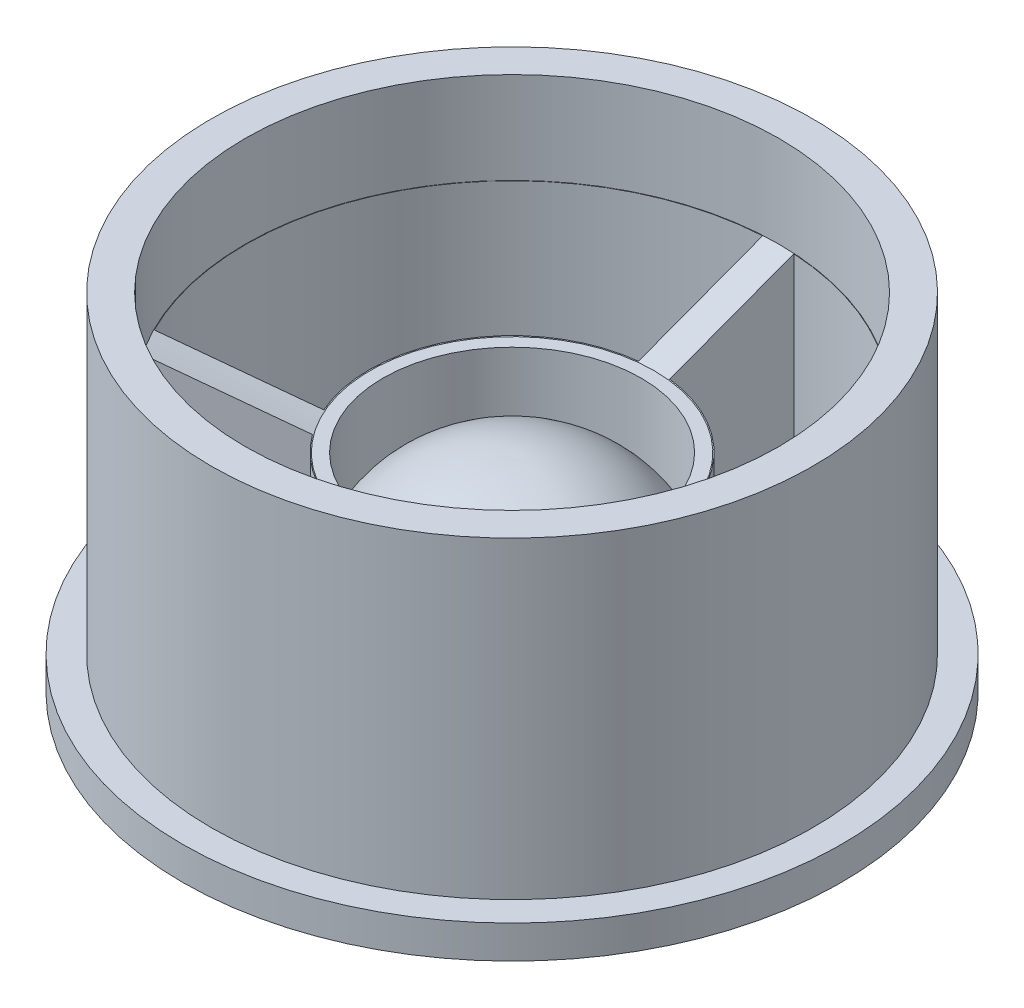
ISO-10303-21;
HEADER;
FILE_DESCRIPTION(('STEP AP214'),'2;1');
FILE_NAME('part.step','',(''),(''),'','','');
FILE_SCHEMA(('AUTOMOTIVE_DESIGN { 1 0 10303 214 1 1 1 1 }'));
ENDSEC;
DATA;
#1=APPLICATION_CONTEXT('core data for automotive mechanical design processes');
#2=APPLICATION_PROTOCOL_DEFINITION('international standard','automotive_design',2000,#1);
#3=PRODUCT_CONTEXT('',#1,'mechanical');
#4=PRODUCT('Part','Part','',(#3));
#5=PRODUCT_RELATED_PRODUCT_CATEGORY('part','',(#4));
#6=PRODUCT_DEFINITION_FORMATION('','',#4);
#7=PRODUCT_DEFINITION_CONTEXT('part definition',#1,'design');
#8=PRODUCT_DEFINITION('design','',#6,#7);
#9=PRODUCT_DEFINITION_SHAPE('','',#8);
#10=(LENGTH_UNIT() NAMED_UNIT(*) SI_UNIT(.MILLI.,.METRE.));
#11=(NAMED_UNIT(*) PLANE_ANGLE_UNIT() SI_UNIT($,.RADIAN.));
#12=(NAMED_UNIT(*) SI_UNIT($,.STERADIAN.) SOLID_ANGLE_UNIT());
#13=UNCERTAINTY_MEASURE_WITH_UNIT(LENGTH_MEASURE(1.E-05),#10,'distance_accuracy_value','');
#14=(GEOMETRIC_REPRESENTATION_CONTEXT(3) GLOBAL_UNCERTAINTY_ASSIGNED_CONTEXT((#13)) GLOBAL_UNIT_ASSIGNED_CONTEXT((#10,
#11,#12)) REPRESENTATION_CONTEXT('',''));
#15=CARTESIAN_POINT('',(0.,0.,0.));
#16=DIRECTION('',(0.,0.,1.));
#17=DIRECTION('',(1.,0.,0.));
#18=AXIS2_PLACEMENT_3D('',#15,#16,#17);
#19=CARTESIAN_POINT('',(0.,1.,0.));
#20=DIRECTION('',(0.,-1.,0.));
#21=DIRECTION('',(0.,0.,-1.));
#22=AXIS2_PLACEMENT_3D('',#19,#20,#21);
#23=CYLINDRICAL_SURFACE('',#22,10.);
#24=CARTESIAN_POINT('',(0.,1.,0.));
#25=DIRECTION('',(0.,1.,0.));
#26=DIRECTION('',(0.,0.,1.));
#27=AXIS2_PLACEMENT_3D('',#24,#25,#26);
#28=CIRCLE('',#27,10.);
#29=CARTESIAN_POINT('',(0.,1.,10.));
#30=VERTEX_POINT('',#29);
#31=EDGE_CURVE('E157',#30,#30,#28,.T.);
#32=ORIENTED_EDGE('',*,*,#31,.F.);
#33=EDGE_LOOP('',(#32));
#34=FACE_BOUND('',#33,.T.);
#35=CARTESIAN_POINT('',(0.,0.,0.));
#36=DIRECTION('',(0.,1.,0.));
#37=DIRECTION('',(0.,0.,1.));
#38=AXIS2_PLACEMENT_3D('',#35,#36,#37);
#39=CIRCLE('',#38,10.);
#40=CARTESIAN_POINT('',(0.,0.,10.));
#41=VERTEX_POINT('',#40);
#42=EDGE_CURVE('E160',#41,#41,#39,.T.);
#43=ORIENTED_EDGE('',*,*,#42,.T.);
#44=EDGE_LOOP('',(#43));
#45=FACE_BOUND('',#44,.T.);
#46=ADVANCED_FACE('F36',(#34,#45),#23,.T.);
#47=CARTESIAN_POINT('',(0.,1.,0.));
#48=DIRECTION('',(0.,1.,0.));
#49=DIRECTION('',(0.,0.,1.));
#50=AXIS2_PLACEMENT_3D('',#47,#48,#49);
#51=PLANE('',#50);
#52=CARTESIAN_POINT('',(0.,1.,0.));
#53=DIRECTION('',(0.,1.,0.));
#54=DIRECTION('',(0.,0.,1.));
#55=AXIS2_PLACEMENT_3D('',#52,#53,#54);
#56=CIRCLE('',#55,9.12834848091899);
#57=CARTESIAN_POINT('',(0.,1.,9.12834848091899));
#58=VERTEX_POINT('',#57);
#59=EDGE_CURVE('E162',#58,#58,#56,.T.);
#60=ORIENTED_EDGE('',*,*,#59,.F.);
#61=EDGE_LOOP('',(#60));
#62=FACE_BOUND('',#61,.T.);
#63=ORIENTED_EDGE('',*,*,#31,.T.);
#64=EDGE_LOOP('',(#63));
#65=FACE_BOUND('',#64,.T.);
#66=ADVANCED_FACE('F146',(#62,#65),#51,.T.);
#67=CARTESIAN_POINT('',(0.,0.,0.));
#68=DIRECTION('',(0.,1.,0.));
#69=DIRECTION('',(0.,0.,1.));
#70=AXIS2_PLACEMENT_3D('',#67,#68,#69);
#71=PLANE('',#70);
#72=CARTESIAN_POINT('',(0.,0.,0.));
#73=DIRECTION('',(0.,-1.,0.));
#74=DIRECTION('',(0.,0.,-1.));
#75=AXIS2_PLACEMENT_3D('',#72,#73,#74);
#76=CIRCLE('',#75,4.27485755579937);
#77=CARTESIAN_POINT('',(0.,0.,-4.27485755579937));
#78=VERTEX_POINT('',#77);
#79=EDGE_CURVE('E11',#78,#78,#76,.T.);
#80=ORIENTED_EDGE('',*,*,#79,.F.);
#81=EDGE_LOOP('',(#80));
#82=FACE_BOUND('',#81,.T.);
#83=ORIENTED_EDGE('',*,*,#42,.F.);
#84=EDGE_LOOP('',(#83));
#85=FACE_BOUND('',#84,.T.);
#86=DIRECTION('',(0.866025403784438,0.,-0.500000000000001));
#87=VECTOR('',#86,1.);
#88=CARTESIAN_POINT('',(0.236570300981502,0.,0.409751780861823));
#89=LINE('',#88,#87);
#90=CARTESIAN_POINT('',(-6.75726344424227,0.,4.44764357633426));
#91=VERTEX_POINT('',#90);
#92=CARTESIAN_POINT('',(-3.4940899034705,0.,2.56364945415722));
#93=VERTEX_POINT('',#92);
#94=EDGE_CURVE('E217',#91,#93,#89,.T.);
#95=ORIENTED_EDGE('',*,*,#94,.F.);
#96=CARTESIAN_POINT('',(0.,0.,0.));
#97=DIRECTION('',(0.,1.,0.));
#98=DIRECTION('',(0.,0.,1.));
#99=AXIS2_PLACEMENT_3D('',#96,#97,#98);
#100=CIRCLE('',#99,8.08963179860495);
#101=CARTESIAN_POINT('',(6.75726344424228,0.,4.44764357633426));
#102=VERTEX_POINT('',#101);
#103=EDGE_CURVE('E208',#91,#102,#100,.T.);
#104=ORIENTED_EDGE('',*,*,#103,.T.);
#105=DIRECTION('',(-0.866025403784439,0.,-0.5));
#106=VECTOR('',#105,1.);
#107=CARTESIAN_POINT('',(-0.236570300981502,0.,0.409751780861823));
#108=LINE('',#107,#106);
#109=CARTESIAN_POINT('',(3.49408990347051,0.,2.56364945415721));
#110=VERTEX_POINT('',#109);
#111=EDGE_CURVE('E211',#102,#110,#108,.T.);
#112=ORIENTED_EDGE('',*,*,#111,.T.);
#113=CARTESIAN_POINT('',(0.,0.,0.));
#114=DIRECTION('',(0.,1.,0.));
#115=DIRECTION('',(0.,0.,1.));
#116=AXIS2_PLACEMENT_3D('',#113,#114,#115);
#117=CIRCLE('',#116,4.33370081770017);
#118=EDGE_CURVE('E214',#93,#110,#117,.T.);
#119=ORIENTED_EDGE('',*,*,#118,.F.);
#120=EDGE_LOOP('',(#95,#104,#112,#119));
#121=FACE_BOUND('',#120,.T.);
#122=DIRECTION('',(0.,0.,1.));
#123=VECTOR('',#122,1.);
#124=CARTESIAN_POINT('',(-0.473140601963005,0.,0.));
#125=LINE('',#124,#123);
#126=CARTESIAN_POINT('',(-0.473140601963004,0.,-8.07578359094487));
#127=VERTEX_POINT('',#126);
#128=CARTESIAN_POINT('',(-0.473140601963004,0.,-4.30779534659078));
#129=VERTEX_POINT('',#128);
#130=EDGE_CURVE('E205',#127,#129,#125,.T.);
#131=ORIENTED_EDGE('',*,*,#130,.F.);
#132=CARTESIAN_POINT('',(-7.23040404620528,0.,3.62814001461062));
#133=VERTEX_POINT('',#132);
#134=EDGE_CURVE('E203',#127,#133,#100,.T.);
#135=ORIENTED_EDGE('',*,*,#134,.T.);
#136=DIRECTION('',(0.866025403784438,0.,-0.5));
#137=VECTOR('',#136,1.);
#138=CARTESIAN_POINT('',(-0.236570300981502,0.,-0.409751780861823));
#139=LINE('',#138,#137);
#140=CARTESIAN_POINT('',(-3.96723050543351,0.,1.74414589243357));
#141=VERTEX_POINT('',#140);
#142=EDGE_CURVE('E200',#133,#141,#139,.T.);
#143=ORIENTED_EDGE('',*,*,#142,.T.);
#144=EDGE_CURVE('E204',#129,#141,#117,.T.);
#145=ORIENTED_EDGE('',*,*,#144,.F.);
#146=EDGE_LOOP('',(#131,#135,#143,#145));
#147=FACE_BOUND('',#146,.T.);
#148=CARTESIAN_POINT('',(3.96723050543351,0.,1.74414589243357));
#149=VERTEX_POINT('',#148);
#150=CARTESIAN_POINT('',(0.473140601963004,0.,-4.30779534659078));
#151=VERTEX_POINT('',#150);
#152=EDGE_CURVE('E199',#149,#151,#117,.T.);
#153=ORIENTED_EDGE('',*,*,#152,.F.);
#154=DIRECTION('',(-0.866025403784439,0.,-0.5));
#155=VECTOR('',#154,1.);
#156=CARTESIAN_POINT('',(0.236570300981502,0.,-0.409751780861824));
#157=LINE('',#156,#155);
#158=CARTESIAN_POINT('',(7.23040404620528,0.,3.62814001461061));
#159=VERTEX_POINT('',#158);
#160=EDGE_CURVE('E192',#159,#149,#157,.T.);
#161=ORIENTED_EDGE('',*,*,#160,.F.);
#162=CARTESIAN_POINT('',(0.473140601963004,0.,-8.07578359094487));
#163=VERTEX_POINT('',#162);
#164=EDGE_CURVE('E195',#159,#163,#100,.T.);
#165=ORIENTED_EDGE('',*,*,#164,.T.);
#166=DIRECTION('',(0.,0.,1.));
#167=VECTOR('',#166,1.);
#168=CARTESIAN_POINT('',(0.473140601963005,0.,0.));
#169=LINE('',#168,#167);
#170=EDGE_CURVE('E196',#163,#151,#169,.T.);
#171=ORIENTED_EDGE('',*,*,#170,.T.);
#172=EDGE_LOOP('',(#153,#161,#165,#171));
#173=FACE_BOUND('',#172,.T.);
#174=ADVANCED_FACE('F151',(#82,#85,#121,#147,#173),#71,.F.);
#175=CARTESIAN_POINT('',(0.,10.5,0.));
#176=DIRECTION('',(0.,-1.,0.));
#177=DIRECTION('',(0.,0.,-1.));
#178=AXIS2_PLACEMENT_3D('',#175,#176,#177);
#179=CYLINDRICAL_SURFACE('',#178,4.33370081770017);
#180=DIRECTION('',(0.,-1.,0.));
#181=VECTOR('',#180,1.);
#182=CARTESIAN_POINT('',(0.473140601963004,10.5,-4.30779534659078));
#183=LINE('',#182,#181);
#184=CARTESIAN_POINT('',(0.473140601963004,6.30317831616433,-4.30779534659078));
#185=VERTEX_POINT('',#184);
#186=EDGE_CURVE('E163',#185,#151,#183,.T.);
#187=ORIENTED_EDGE('',*,*,#186,.F.);
#188=CARTESIAN_POINT('',(0.,6.30317831616433,0.));
#189=DIRECTION('',(0.,1.,0.));
#190=DIRECTION('',(0.,0.,1.));
#191=AXIS2_PLACEMENT_3D('',#188,#189,#190);
#192=CIRCLE('',#191,4.33370081770017);
#193=CARTESIAN_POINT('',(3.96723050543351,6.30317831616433,1.74414589243357));
#194=VERTEX_POINT('',#193);
#195=EDGE_CURVE('E220',#185,#194,#192,.F.);
#196=ORIENTED_EDGE('',*,*,#195,.T.);
#197=DIRECTION('',(0.,-1.,0.));
#198=VECTOR('',#197,1.);
#199=CARTESIAN_POINT('',(3.96723050543351,10.5,1.74414589243357));
#200=LINE('',#199,#198);
#201=EDGE_CURVE('E182',#194,#149,#200,.T.);
#202=ORIENTED_EDGE('',*,*,#201,.T.);
#203=ORIENTED_EDGE('',*,*,#152,.T.);
#204=EDGE_LOOP('',(#187,#196,#202,#203));
#205=FACE_BOUND('',#204,.T.);
#206=ADVANCED_FACE('F308',(#205),#179,.T.);
#207=CARTESIAN_POINT('',(0.473140601963005,10.5,0.));
#208=DIRECTION('',(1.,0.,0.));
#209=DIRECTION('',(0.,0.,-1.));
#210=AXIS2_PLACEMENT_3D('',#207,#208,#209);
#211=PLANE('',#210);
#212=CARTESIAN_POINT('',(0.473140601963005,5.18608387009219,-1.27796961452716));
#213=CARTESIAN_POINT('',(0.473140601963005,5.22514785309742,-1.38860017975807));
#214=CARTESIAN_POINT('',(0.473140601963005,5.26465001853593,-1.49907399002225));
#215=CARTESIAN_POINT('',(0.473140601963005,5.34425188255228,-1.71980480724532));
#216=CARTESIAN_POINT('',(0.473140601963005,5.38435157346284,-1.8300618169656));
#217=CARTESIAN_POINT('',(0.473140601963005,5.46487010357933,-2.05045701383037));
#218=CARTESIAN_POINT('',(0.473140601963005,5.50528893826629,-2.16059520263231));
#219=CARTESIAN_POINT('',(0.473140601963005,5.586342211713,-2.38079273631188));
#220=CARTESIAN_POINT('',(0.473140601963005,5.62697665133115,-2.49085208087362));
#221=CARTESIAN_POINT('',(0.473140601963005,5.7422051871244,-2.80233913681282));
#222=CARTESIAN_POINT('',(0.473140601963005,5.81696448565699,-3.00370568639863));
#223=CARTESIAN_POINT('',(0.473140601963005,5.96673825497437,-3.40634389879204));
#224=CARTESIAN_POINT('',(0.473140601963005,6.04175272590419,-3.60761556154564));
#225=CARTESIAN_POINT('',(0.473140601963004,6.26702240461792,-4.21134580088081));
#226=CARTESIAN_POINT('',(0.473140601963004,6.41750397584828,-4.61371989110107));
#227=CARTESIAN_POINT('',(0.473140601963004,6.71872940241771,-5.41838006898415));
#228=CARTESIAN_POINT('',(0.473140601963004,6.86947326356206,-5.82066615447148));
#229=CARTESIAN_POINT('',(0.473140601963004,7.17110506792998,-6.62518417639193));
#230=CARTESIAN_POINT('',(0.473140601963004,7.32199301111093,-7.02741611284103));
#231=CARTESIAN_POINT('',(0.473140601963004,7.70767273434663,-8.05522534667331));
#232=CARTESIAN_POINT('',(0.473140601963004,7.94252343270555,-8.68078053054355));
#233=CARTESIAN_POINT('',(0.473140601963004,8.41232698779264,-9.93185262265175));
#234=CARTESIAN_POINT('',(0.473140601963004,8.64727984453379,-10.5573695308848));
#235=CARTESIAN_POINT('',(0.473140601963003,9.11723650320287,-11.8083571374668));
#236=CARTESIAN_POINT('',(0.473140601963003,9.35224030286077,-12.4338278366685));
#237=CARTESIAN_POINT('',(0.473140601963003,9.82228747260761,-13.6847542581489));
#238=CARTESIAN_POINT('',(0.473140601963003,10.0573308426906,-14.3102099804298));
#239=CARTESIAN_POINT('',(0.473140601963003,10.2923838926268,-14.9356620634894));
#240=B_SPLINE_CURVE_WITH_KNOTS('',3,(#212,#213,#214,#215,#216,#217,#218,#219,#220,#221,#222,
#223,#224,#225,#226,#227,#228,#229,#230,#231,#232,#233,#234,#235,#236,#237,#238,#239),
.UNSPECIFIED.,.F.,.F.,(4,2,2,2,2,2,2,2,2,2,2,2,2,4),(0.,0.351970897845239,0.703937283188398,
1.05589869371611,1.40786150654829,2.05224998274728,2.69663882523905,3.98541566995256,
5.27422141157208,6.56302677196781,8.56758836654761,10.5721502159122,12.5766360418839,
14.581121563967),.UNSPECIFIED.);
#241=CARTESIAN_POINT('',(0.473140601963004,7.71542643084749,-8.07578359094487));
#242=VERTEX_POINT('',#241);
#243=EDGE_CURVE('E225',#185,#242,#240,.T.);
#244=ORIENTED_EDGE('',*,*,#243,.F.);
#245=ORIENTED_EDGE('',*,*,#186,.T.);
#246=ORIENTED_EDGE('',*,*,#170,.F.);
#247=DIRECTION('',(0.,-1.,0.));
#248=VECTOR('',#247,1.);
#249=CARTESIAN_POINT('',(0.473140601963004,10.5,-8.07578359094487));
#250=LINE('',#249,#248);
#251=EDGE_CURVE('E166',#242,#163,#250,.T.);
#252=ORIENTED_EDGE('',*,*,#251,.F.);
#253=EDGE_LOOP('',(#244,#245,#246,#252));
#254=FACE_BOUND('',#253,.T.);
#255=ADVANCED_FACE('F234',(#254),#211,.T.);
#256=CARTESIAN_POINT('',(0.,10.5,0.));
#257=DIRECTION('',(0.,-1.,0.));
#258=DIRECTION('',(0.,0.,-1.));
#259=AXIS2_PLACEMENT_3D('',#256,#257,#258);
#260=CYLINDRICAL_SURFACE('',#259,8.08963179860495);
#261=CARTESIAN_POINT('',(0.,7.71542643084749,0.));
#262=DIRECTION('',(0.,1.,0.));
#263=DIRECTION('',(0.,0.,1.));
#264=AXIS2_PLACEMENT_3D('',#261,#262,#263);
#265=CIRCLE('',#264,8.08963179860495);
#266=CARTESIAN_POINT('',(7.23040404620528,7.71542643084749,3.62814001461061));
#267=VERTEX_POINT('',#266);
#268=EDGE_CURVE('E51',#242,#267,#265,.F.);
#269=ORIENTED_EDGE('',*,*,#268,.F.);
#270=ORIENTED_EDGE('',*,*,#251,.T.);
#271=ORIENTED_EDGE('',*,*,#164,.F.);
#272=DIRECTION('',(0.,-1.,0.));
#273=VECTOR('',#272,1.);
#274=CARTESIAN_POINT('',(7.23040404620528,10.5,3.62814001461061));
#275=LINE('',#274,#273);
#276=EDGE_CURVE('E189',#267,#159,#275,.T.);
#277=ORIENTED_EDGE('',*,*,#276,.F.);
#278=EDGE_LOOP('',(#269,#270,#271,#277));
#279=FACE_BOUND('',#278,.T.);
#280=ADVANCED_FACE('F297',(#279),#260,.F.);
#281=CARTESIAN_POINT('',(-0.473140601963005,10.5,0.));
#282=DIRECTION('',(1.,0.,0.));
#283=DIRECTION('',(0.,0.,-1.));
#284=AXIS2_PLACEMENT_3D('',#281,#282,#283);
#285=PLANE('',#284);
#286=DIRECTION('',(0.,-1.,0.));
#287=VECTOR('',#286,1.);
#288=CARTESIAN_POINT('',(-0.473140601963004,10.5,-4.30779534659078));
#289=LINE('',#288,#287);
#290=CARTESIAN_POINT('',(-0.473140601963004,6.30317831616433,-4.30779534659078));
#291=VERTEX_POINT('',#290);
#292=EDGE_CURVE('E180',#291,#129,#289,.T.);
#293=ORIENTED_EDGE('',*,*,#292,.F.);
#294=CARTESIAN_POINT('',(-0.473140601963005,5.18608387009219,-1.27796961452716));
#295=CARTESIAN_POINT('',(-0.473140601963005,5.22514785309742,-1.38860017975807));
#296=CARTESIAN_POINT('',(-0.473140601963005,5.26465001853593,-1.49907399002225));
#297=CARTESIAN_POINT('',(-0.473140601963005,5.34425188255228,-1.71980480724532));
#298=CARTESIAN_POINT('',(-0.473140601963005,5.38435157346284,-1.8300618169656));
#299=CARTESIAN_POINT('',(-0.473140601963005,5.46487010357933,-2.05045701383037));
#300=CARTESIAN_POINT('',(-0.473140601963005,5.50528893826629,-2.16059520263231));
#301=CARTESIAN_POINT('',(-0.473140601963005,5.586342211713,-2.38079273631188));
#302=CARTESIAN_POINT('',(-0.473140601963005,5.62697665133115,-2.49085208087362));
#303=CARTESIAN_POINT('',(-0.473140601963005,5.7422051871244,-2.80233913681282));
#304=CARTESIAN_POINT('',(-0.473140601963005,5.81696448565699,-3.00370568639863));
#305=CARTESIAN_POINT('',(-0.473140601963005,5.96673825497437,-3.40634389879204));
#306=CARTESIAN_POINT('',(-0.473140601963005,6.04175272590419,-3.60761556154564));
#307=CARTESIAN_POINT('',(-0.473140601963004,6.26702240461792,-4.21134580088081));
#308=CARTESIAN_POINT('',(-0.473140601963004,6.41750397584828,-4.61371989110107));
#309=CARTESIAN_POINT('',(-0.473140601963004,6.71872940241771,-5.41838006898415));
#310=CARTESIAN_POINT('',(-0.473140601963004,6.86947326356206,-5.82066615447148));
#311=CARTESIAN_POINT('',(-0.473140601963004,7.17110506792998,-6.62518417639193));
#312=CARTESIAN_POINT('',(-0.473140601963004,7.32199301111093,-7.02741611284103));
#313=CARTESIAN_POINT('',(-0.473140601963004,7.70767273434663,-8.05522534667331));
#314=CARTESIAN_POINT('',(-0.473140601963004,7.94252343270555,-8.68078053054355));
#315=CARTESIAN_POINT('',(-0.473140601963004,8.41232698779264,-9.93185262265175));
#316=CARTESIAN_POINT('',(-0.473140601963004,8.64727984453379,-10.5573695308848));
#317=CARTESIAN_POINT('',(-0.473140601963003,9.11723650320287,-11.8083571374668));
#318=CARTESIAN_POINT('',(-0.473140601963003,9.35224030286077,-12.4338278366685));
#319=CARTESIAN_POINT('',(-0.473140601963003,9.82228747260761,-13.6847542581489));
#320=CARTESIAN_POINT('',(-0.473140601963003,10.0573308426906,-14.3102099804298));
#321=CARTESIAN_POINT('',(-0.473140601963003,10.2923838926268,-14.9356620634894));
#322=B_SPLINE_CURVE_WITH_KNOTS('',3,(#294,#295,#296,#297,#298,#299,#300,#301,#302,#303,#304,
#305,#306,#307,#308,#309,#310,#311,#312,#313,#314,#315,#316,#317,#318,#319,#320,#321),
.UNSPECIFIED.,.F.,.F.,(4,2,2,2,2,2,2,2,2,2,2,2,2,4),(0.,0.351970897845239,0.703937283188398,
1.05589869371611,1.40786150654829,2.05224998274728,2.69663882523905,3.98541566995256,
5.27422141157208,6.56302677196781,8.56758836654761,10.5721502159122,12.5766360418839,
14.581121563967),.UNSPECIFIED.);
#323=CARTESIAN_POINT('',(-0.473140601963004,7.71542643084749,-8.07578359094487));
#324=VERTEX_POINT('',#323);
#325=EDGE_CURVE('E277',#291,#324,#322,.T.);
#326=ORIENTED_EDGE('',*,*,#325,.T.);
#327=DIRECTION('',(0.,-1.,0.));
#328=VECTOR('',#327,1.);
#329=CARTESIAN_POINT('',(-0.473140601963004,10.5,-8.07578359094487));
#330=LINE('',#329,#328);
#331=EDGE_CURVE('E172',#324,#127,#330,.T.);
#332=ORIENTED_EDGE('',*,*,#331,.T.);
#333=ORIENTED_EDGE('',*,*,#130,.T.);
#334=EDGE_LOOP('',(#293,#326,#332,#333));
#335=FACE_BOUND('',#334,.T.);
#336=ADVANCED_FACE('F299',(#335),#285,.F.);
#337=DIRECTION('',(0.,-1.,0.));
#338=VECTOR('',#337,1.);
#339=CARTESIAN_POINT('',(-3.96723050543351,10.5,1.74414589243357));
#340=LINE('',#339,#338);
#341=CARTESIAN_POINT('',(-3.96723050543351,6.30317831616433,1.74414589243357));
#342=VERTEX_POINT('',#341);
#343=EDGE_CURVE('E183',#342,#141,#340,.T.);
#344=ORIENTED_EDGE('',*,*,#343,.F.);
#345=CARTESIAN_POINT('',(0.,6.30317831616433,0.));
#346=DIRECTION('',(0.,1.,0.));
#347=DIRECTION('',(0.,0.,1.));
#348=AXIS2_PLACEMENT_3D('',#345,#346,#347);
#349=CIRCLE('',#348,4.33370081770017);
#350=EDGE_CURVE('E358',#342,#291,#349,.F.);
#351=ORIENTED_EDGE('',*,*,#350,.T.);
#352=ORIENTED_EDGE('',*,*,#292,.T.);
#353=ORIENTED_EDGE('',*,*,#144,.T.);
#354=EDGE_LOOP('',(#344,#351,#352,#353));
#355=FACE_BOUND('',#354,.T.);
#356=ADVANCED_FACE('F306',(#355),#179,.T.);
#357=CARTESIAN_POINT('',(-0.236570300981502,10.5,-0.409751780861823));
#358=DIRECTION('',(-0.5,0.,-0.866025403784438));
#359=DIRECTION('',(-0.866025403784439,0.,0.5));
#360=AXIS2_PLACEMENT_3D('',#357,#358,#359);
#361=PLANE('',#360);
#362=CARTESIAN_POINT('',(-3.96703050543351,6.3030920006699,1.74403042237973));
#363=CARTESIAN_POINT('',(-4.23908482625063,6.42051678373961,1.90110105773769));
#364=CARTESIAN_POINT('',(-4.511103202554,6.53805248269884,2.05815094052097));
#365=CARTESIAN_POINT('',(-5.05508997459177,6.77327790737905,2.37222184979258));
#366=CARTESIAN_POINT('',(-5.32705837033165,6.89096763308317,2.52924287628407));
#367=CARTESIAN_POINT('',(-5.87096712640736,7.12643332208348,2.84326874301897));
#368=CARTESIAN_POINT('',(-6.14290748674555,7.24420928537241,3.00027358326375));
#369=CARTESIAN_POINT('',(-6.68676849243888,7.47982199050463,3.31427188130254));
#370=CARTESIAN_POINT('',(-6.95868913779198,7.59765873235422,3.47126533909537));
#371=CARTESIAN_POINT('',(-7.23060404620528,7.71551311679554,3.62825548466445));
#372=B_SPLINE_CURVE_WITH_KNOTS('',3,(#362,#363,#364,#365,#366,#367,#368,#369,#370,#371),
.UNSPECIFIED.,.F.,.F.,(4,2,2,2,4),(0.,1.00611117531537,2.01222224038555,3.01833322071733,
4.02444430539752),.UNSPECIFIED.);
#373=CARTESIAN_POINT('',(-7.23040404620528,7.71542643084749,3.62814001461062));
#374=VERTEX_POINT('',#373);
#375=EDGE_CURVE('E59',#342,#374,#372,.T.);
#376=ORIENTED_EDGE('',*,*,#375,.F.);
#377=ORIENTED_EDGE('',*,*,#343,.T.);
#378=ORIENTED_EDGE('',*,*,#142,.F.);
#379=DIRECTION('',(0.,-1.,0.));
#380=VECTOR('',#379,1.);
#381=CARTESIAN_POINT('',(-7.23040404620528,10.5,3.62814001461062));
#382=LINE('',#381,#380);
#383=EDGE_CURVE('E185',#374,#133,#382,.T.);
#384=ORIENTED_EDGE('',*,*,#383,.F.);
#385=EDGE_LOOP('',(#376,#377,#378,#384));
#386=FACE_BOUND('',#385,.T.);
#387=ADVANCED_FACE('F323',(#386),#361,.T.);
#388=CARTESIAN_POINT('',(0.236570300981502,10.5,0.409751780861823));
#389=DIRECTION('',(-0.500000000000001,0.,-0.866025403784438));
#390=DIRECTION('',(-0.866025403784438,0.,0.500000000000001));
#391=AXIS2_PLACEMENT_3D('',#388,#389,#390);
#392=PLANE('',#391);
#393=DIRECTION('',(0.,-1.,0.));
#394=VECTOR('',#393,1.);
#395=CARTESIAN_POINT('',(-3.4940899034705,10.5,2.56364945415722));
#396=LINE('',#395,#394);
#397=CARTESIAN_POINT('',(-3.4940899034705,6.30317831616433,2.56364945415722));
#398=VERTEX_POINT('',#397);
#399=EDGE_CURVE('E170',#398,#93,#396,.T.);
#400=ORIENTED_EDGE('',*,*,#399,.F.);
#401=CARTESIAN_POINT('',(-3.4938899034705,6.3030920006699,2.56353398410338));
#402=CARTESIAN_POINT('',(-3.76594422428762,6.42051678373961,2.72060461946134));
#403=CARTESIAN_POINT('',(-4.03796260059099,6.53805248269884,2.87765450224462));
#404=CARTESIAN_POINT('',(-4.58194937262877,6.77327790737905,3.19172541151622));
#405=CARTESIAN_POINT('',(-4.85391776836864,6.89096763308317,3.34874643800771));
#406=CARTESIAN_POINT('',(-5.39782652444435,7.12643332208348,3.66277230474262));
#407=CARTESIAN_POINT('',(-5.66976688478254,7.24420928537241,3.81977714498739));
#408=CARTESIAN_POINT('',(-6.21362789047588,7.47982199050463,4.13377544302618));
#409=CARTESIAN_POINT('',(-6.48554853582898,7.59765873235422,4.29076890081901));
#410=CARTESIAN_POINT('',(-6.75746344424227,7.71551311679554,4.4477590463881));
#411=B_SPLINE_CURVE_WITH_KNOTS('',3,(#401,#402,#403,#404,#405,#406,#407,#408,#409,#410),
.UNSPECIFIED.,.F.,.F.,(4,2,2,2,4),(0.,1.00611117531537,2.01222224038555,3.01833322071733,
4.02444430539752),.UNSPECIFIED.);
#412=CARTESIAN_POINT('',(-6.75726344424227,7.71542643084749,4.44764357633426));
#413=VERTEX_POINT('',#412);
#414=EDGE_CURVE('E261',#398,#413,#411,.T.);
#415=ORIENTED_EDGE('',*,*,#414,.T.);
#416=DIRECTION('',(0.,-1.,0.));
#417=VECTOR('',#416,1.);
#418=CARTESIAN_POINT('',(-6.75726344424227,10.5,4.44764357633426));
#419=LINE('',#418,#417);
#420=EDGE_CURVE('E177',#413,#91,#419,.T.);
#421=ORIENTED_EDGE('',*,*,#420,.T.);
#422=ORIENTED_EDGE('',*,*,#94,.T.);
#423=EDGE_LOOP('',(#400,#415,#421,#422));
#424=FACE_BOUND('',#423,.T.);
#425=ADVANCED_FACE('F350',(#424),#392,.F.);
#426=DIRECTION('',(0.,-1.,0.));
#427=VECTOR('',#426,1.);
#428=CARTESIAN_POINT('',(3.49408990347051,10.5,2.56364945415721));
#429=LINE('',#428,#427);
#430=CARTESIAN_POINT('',(3.49408990347051,6.30317831616433,2.56364945415721));
#431=VERTEX_POINT('',#430);
#432=EDGE_CURVE('E173',#431,#110,#429,.T.);
#433=ORIENTED_EDGE('',*,*,#432,.F.);
#434=CARTESIAN_POINT('',(0.,6.30317831616433,0.));
#435=DIRECTION('',(0.,1.,0.));
#436=DIRECTION('',(0.,0.,1.));
#437=AXIS2_PLACEMENT_3D('',#434,#435,#436);
#438=CIRCLE('',#437,4.33370081770017);
#439=EDGE_CURVE('E378',#431,#398,#438,.F.);
#440=ORIENTED_EDGE('',*,*,#439,.T.);
#441=ORIENTED_EDGE('',*,*,#399,.T.);
#442=ORIENTED_EDGE('',*,*,#118,.T.);
#443=EDGE_LOOP('',(#433,#440,#441,#442));
#444=FACE_BOUND('',#443,.T.);
#445=ADVANCED_FACE('F344',(#444),#179,.T.);
#446=CARTESIAN_POINT('',(-0.236570300981502,10.5,0.409751780861823));
#447=DIRECTION('',(-0.5,0.,0.866025403784439));
#448=DIRECTION('',(0.866025403784439,0.,0.5));
#449=AXIS2_PLACEMENT_3D('',#446,#447,#448);
#450=PLANE('',#449);
#451=CARTESIAN_POINT('',(3.49388990347051,6.3030920006699,2.56353398410337));
#452=CARTESIAN_POINT('',(3.76594422428762,6.42051678373961,2.72060461946134));
#453=CARTESIAN_POINT('',(4.03796260059099,6.53805248269884,2.87765450224461));
#454=CARTESIAN_POINT('',(4.58194937262877,6.77327790737905,3.19172541151622));
#455=CARTESIAN_POINT('',(4.85391776836865,6.89096763308317,3.34874643800771));
#456=CARTESIAN_POINT('',(5.39782652444435,7.12643332208348,3.66277230474261));
#457=CARTESIAN_POINT('',(5.66976688478254,7.24420928537241,3.81977714498739));
#458=CARTESIAN_POINT('',(6.21362789047588,7.47982199050463,4.13377544302618));
#459=CARTESIAN_POINT('',(6.48554853582898,7.59765873235422,4.29076890081901));
#460=CARTESIAN_POINT('',(6.75746344424228,7.71551311679554,4.4477590463881));
#461=B_SPLINE_CURVE_WITH_KNOTS('',3,(#451,#452,#453,#454,#455,#456,#457,#458,#459,#460),
.UNSPECIFIED.,.F.,.F.,(4,2,2,2,4),(0.,1.00611117531537,2.01222224038555,3.01833322071733,
4.02444430539752),.UNSPECIFIED.);
#462=CARTESIAN_POINT('',(6.75726344424228,7.71542643084749,4.44764357633426));
#463=VERTEX_POINT('',#462);
#464=EDGE_CURVE('E250',#431,#463,#461,.T.);
#465=ORIENTED_EDGE('',*,*,#464,.F.);
#466=ORIENTED_EDGE('',*,*,#432,.T.);
#467=ORIENTED_EDGE('',*,*,#111,.F.);
#468=DIRECTION('',(0.,-1.,0.));
#469=VECTOR('',#468,1.);
#470=CARTESIAN_POINT('',(6.75726344424228,10.5,4.44764357633426));
#471=LINE('',#470,#469);
#472=EDGE_CURVE('E175',#463,#102,#471,.T.);
#473=ORIENTED_EDGE('',*,*,#472,.F.);
#474=EDGE_LOOP('',(#465,#466,#467,#473));
#475=FACE_BOUND('',#474,.T.);
#476=ADVANCED_FACE('F294',(#475),#450,.T.);
#477=CARTESIAN_POINT('',(0.236570300981502,10.5,-0.409751780861824));
#478=DIRECTION('',(-0.5,0.,0.866025403784439));
#479=DIRECTION('',(0.866025403784439,0.,0.5));
#480=AXIS2_PLACEMENT_3D('',#477,#478,#479);
#481=PLANE('',#480);
#482=ORIENTED_EDGE('',*,*,#201,.F.);
#483=CARTESIAN_POINT('',(3.96703050543351,6.3030920006699,1.74403042237973));
#484=CARTESIAN_POINT('',(4.23908482625063,6.42051678373961,1.90110105773769));
#485=CARTESIAN_POINT('',(4.511103202554,6.53805248269884,2.05815094052097));
#486=CARTESIAN_POINT('',(5.05508997459177,6.77327790737905,2.37222184979257));
#487=CARTESIAN_POINT('',(5.32705837033165,6.89096763308317,2.52924287628406));
#488=CARTESIAN_POINT('',(5.87096712640736,7.12643332208348,2.84326874301897));
#489=CARTESIAN_POINT('',(6.14290748674555,7.24420928537241,3.00027358326374));
#490=CARTESIAN_POINT('',(6.68676849243888,7.47982199050463,3.31427188130253));
#491=CARTESIAN_POINT('',(6.95868913779198,7.59765873235422,3.47126533909536));
#492=CARTESIAN_POINT('',(7.23060404620528,7.71551311679554,3.62825548466445));
#493=B_SPLINE_CURVE_WITH_KNOTS('',3,(#483,#484,#485,#486,#487,#488,#489,#490,#491,#492),
.UNSPECIFIED.,.F.,.F.,(4,2,2,2,4),(0.,1.00611117531537,2.01222224038555,3.01833322071733,
4.02444430539752),.UNSPECIFIED.);
#494=EDGE_CURVE('E283',#194,#267,#493,.T.);
#495=ORIENTED_EDGE('',*,*,#494,.T.);
#496=ORIENTED_EDGE('',*,*,#276,.T.);
#497=ORIENTED_EDGE('',*,*,#160,.T.);
#498=EDGE_LOOP('',(#482,#495,#496,#497));
#499=FACE_BOUND('',#498,.T.);
#500=ADVANCED_FACE('F289',(#499),#481,.F.);
#501=CARTESIAN_POINT('',(0.,7.71542643084749,0.));
#502=DIRECTION('',(0.,1.,0.));
#503=DIRECTION('',(0.,0.,1.));
#504=AXIS2_PLACEMENT_3D('',#501,#502,#503);
#505=CIRCLE('',#504,8.08963179860495);
#506=EDGE_CURVE('E317',#374,#324,#505,.F.);
#507=ORIENTED_EDGE('',*,*,#506,.F.);
#508=ORIENTED_EDGE('',*,*,#383,.T.);
#509=ORIENTED_EDGE('',*,*,#134,.F.);
#510=ORIENTED_EDGE('',*,*,#331,.F.);
#511=EDGE_LOOP('',(#507,#508,#509,#510));
#512=FACE_BOUND('',#511,.T.);
#513=ADVANCED_FACE('F293',(#512),#260,.F.);
#514=CARTESIAN_POINT('',(0.,7.71542643084749,0.));
#515=DIRECTION('',(0.,1.,0.));
#516=DIRECTION('',(0.,0.,1.));
#517=AXIS2_PLACEMENT_3D('',#514,#515,#516);
#518=CIRCLE('',#517,8.08963179860495);
#519=EDGE_CURVE('E39',#463,#413,#518,.F.);
#520=ORIENTED_EDGE('',*,*,#519,.F.);
#521=ORIENTED_EDGE('',*,*,#472,.T.);
#522=ORIENTED_EDGE('',*,*,#103,.F.);
#523=ORIENTED_EDGE('',*,*,#420,.F.);
#524=EDGE_LOOP('',(#520,#521,#522,#523));
#525=FACE_BOUND('',#524,.T.);
#526=ADVANCED_FACE('F301',(#525),#260,.F.);
#527=CARTESIAN_POINT('',(0.,10.5,0.));
#528=DIRECTION('',(0.,-1.,0.));
#529=DIRECTION('',(0.,0.,-1.));
#530=AXIS2_PLACEMENT_3D('',#527,#528,#529);
#531=CYLINDRICAL_SURFACE('',#530,9.12834848091899);
#532=ORIENTED_EDGE('',*,*,#59,.T.);
#533=EDGE_LOOP('',(#532));
#534=FACE_BOUND('',#533,.T.);
#535=CARTESIAN_POINT('',(0.,10.5,0.));
#536=DIRECTION('',(0.,1.,0.));
#537=DIRECTION('',(0.,0.,1.));
#538=AXIS2_PLACEMENT_3D('',#535,#536,#537);
#539=CIRCLE('',#538,9.12834848091899);
#540=CARTESIAN_POINT('',(0.,10.5,9.12834848091899));
#541=VERTEX_POINT('',#540);
#542=EDGE_CURVE('E179',#541,#541,#539,.T.);
#543=ORIENTED_EDGE('',*,*,#542,.F.);
#544=EDGE_LOOP('',(#543));
#545=FACE_BOUND('',#544,.T.);
#546=ADVANCED_FACE('F296',(#534,#545),#531,.T.);
#547=CARTESIAN_POINT('',(0.,10.5,0.));
#548=DIRECTION('',(0.,1.,0.));
#549=DIRECTION('',(0.,0.,1.));
#550=AXIS2_PLACEMENT_3D('',#547,#548,#549);
#551=PLANE('',#550);
#552=CARTESIAN_POINT('',(0.,10.5,0.));
#553=DIRECTION('',(0.,-1.,0.));
#554=DIRECTION('',(0.,0.,-1.));
#555=AXIS2_PLACEMENT_3D('',#552,#553,#554);
#556=CIRCLE('',#555,8.09901684772285);
#557=CARTESIAN_POINT('',(0.,10.5,-8.09901684772285));
#558=VERTEX_POINT('',#557);
#559=EDGE_CURVE('E379',#558,#558,#556,.T.);
#560=ORIENTED_EDGE('',*,*,#559,.T.);
#561=EDGE_LOOP('',(#560));
#562=FACE_BOUND('',#561,.T.);
#563=ORIENTED_EDGE('',*,*,#542,.T.);
#564=EDGE_LOOP('',(#563));
#565=FACE_BOUND('',#564,.T.);
#566=ADVANCED_FACE('F244',(#562,#565),#551,.T.);
#567=CARTESIAN_POINT('',(0.,6.29343773442302,0.));
#568=DIRECTION('',(0.,1.,0.));
#569=DIRECTION('',(0.,0.,1.));
#570=AXIS2_PLACEMENT_3D('',#567,#568,#569);
#571=CONICAL_SURFACE('',#570,4.30779534659078,1.21114501839298);
#572=CARTESIAN_POINT('',(0.,7.7189552544575,0.));
#573=DIRECTION('',(0.,-1.,0.));
#574=DIRECTION('',(0.,0.,-1.));
#575=AXIS2_PLACEMENT_3D('',#572,#573,#574);
#576=CIRCLE('',#575,8.09901684772285);
#577=CARTESIAN_POINT('',(0.,7.7189552544575,-8.09901684772285));
#578=VERTEX_POINT('',#577);
#579=EDGE_CURVE('E389',#578,#578,#576,.T.);
#580=ORIENTED_EDGE('',*,*,#579,.F.);
#581=EDGE_LOOP('',(#580));
#582=FACE_BOUND('',#581,.T.);
#583=CARTESIAN_POINT('',(0.,6.29343773442302,0.));
#584=DIRECTION('',(0.,-1.,0.));
#585=DIRECTION('',(0.,0.,-1.));
#586=AXIS2_PLACEMENT_3D('',#583,#584,#585);
#587=CIRCLE('',#586,4.30779534659078);
#588=CARTESIAN_POINT('',(0.,6.29343773442302,-4.30779534659078));
#589=VERTEX_POINT('',#588);
#590=EDGE_CURVE('E393',#589,#589,#587,.T.);
#591=ORIENTED_EDGE('',*,*,#590,.T.);
#592=EDGE_LOOP('',(#591));
#593=FACE_BOUND('',#592,.T.);
#594=ORIENTED_EDGE('',*,*,#439,.F.);
#595=ORIENTED_EDGE('',*,*,#464,.T.);
#596=ORIENTED_EDGE('',*,*,#519,.T.);
#597=ORIENTED_EDGE('',*,*,#414,.F.);
#598=EDGE_LOOP('',(#594,#595,#596,#597));
#599=FACE_BOUND('',#598,.T.);
#600=ORIENTED_EDGE('',*,*,#350,.F.);
#601=ORIENTED_EDGE('',*,*,#375,.T.);
#602=ORIENTED_EDGE('',*,*,#506,.T.);
#603=ORIENTED_EDGE('',*,*,#325,.F.);
#604=EDGE_LOOP('',(#600,#601,#602,#603));
#605=FACE_BOUND('',#604,.T.);
#606=ORIENTED_EDGE('',*,*,#243,.T.);
#607=ORIENTED_EDGE('',*,*,#268,.T.);
#608=ORIENTED_EDGE('',*,*,#494,.F.);
#609=ORIENTED_EDGE('',*,*,#195,.F.);
#610=EDGE_LOOP('',(#606,#607,#608,#609));
#611=FACE_BOUND('',#610,.T.);
#612=ADVANCED_FACE('F238',(#582,#593,#599,#605,#611),#571,.F.);
#613=CARTESIAN_POINT('',(0.,2.70272872410765,0.));
#614=DIRECTION('',(0.,-1.,0.));
#615=DIRECTION('',(0.,0.,-1.));
#616=AXIS2_PLACEMENT_3D('',#613,#614,#615);
#617=CYLINDRICAL_SURFACE('',#616,8.09901684772285);
#618=ORIENTED_EDGE('',*,*,#559,.F.);
#619=EDGE_LOOP('',(#618));
#620=FACE_BOUND('',#619,.T.);
#621=ORIENTED_EDGE('',*,*,#579,.T.);
#622=EDGE_LOOP('',(#621));
#623=FACE_BOUND('',#622,.T.);
#624=ADVANCED_FACE('F243',(#620,#623),#617,.F.);
#625=CARTESIAN_POINT('',(0.,6.29343773442302,-4.30779534659078));
#626=DIRECTION('',(0.,-1.,0.));
#627=DIRECTION('',(0.,0.,-1.));
#628=AXIS2_PLACEMENT_3D('',#625,#626,#627);
#629=PLANE('',#628);
#630=ORIENTED_EDGE('',*,*,#590,.F.);
#631=EDGE_LOOP('',(#630));
#632=FACE_BOUND('',#631,.T.);
#633=CARTESIAN_POINT('',(0.,6.29343773442302,0.));
#634=DIRECTION('',(0.,-1.,0.));
#635=DIRECTION('',(0.,0.,-1.));
#636=AXIS2_PLACEMENT_3D('',#633,#634,#635);
#637=CIRCLE('',#636,3.9167285976756);
#638=CARTESIAN_POINT('',(0.,6.29343773442302,-3.9167285976756));
#639=VERTEX_POINT('',#638);
#640=EDGE_CURVE('E398',#639,#639,#637,.T.);
#641=ORIENTED_EDGE('',*,*,#640,.T.);
#642=EDGE_LOOP('',(#641));
#643=FACE_BOUND('',#642,.T.);
#644=ADVANCED_FACE('F139',(#632,#643),#629,.F.);
#645=CARTESIAN_POINT('',(0.,2.70272872410765,0.));
#646=DIRECTION('',(0.,-1.,0.));
#647=DIRECTION('',(0.,0.,-1.));
#648=AXIS2_PLACEMENT_3D('',#645,#646,#647);
#649=CYLINDRICAL_SURFACE('',#648,3.9167285976756);
#650=ORIENTED_EDGE('',*,*,#640,.F.);
#651=EDGE_LOOP('',(#650));
#652=FACE_BOUND('',#651,.T.);
#653=CARTESIAN_POINT('',(0.,3.96413075479407,0.));
#654=DIRECTION('',(0.,-1.,0.));
#655=DIRECTION('',(0.,0.,-1.));
#656=AXIS2_PLACEMENT_3D('',#653,#654,#655);
#657=CIRCLE('',#656,3.9167285976756);
#658=CARTESIAN_POINT('',(0.,3.96413075479407,-3.9167285976756));
#659=VERTEX_POINT('',#658);
#660=EDGE_CURVE('E401',#659,#659,#657,.T.);
#661=ORIENTED_EDGE('',*,*,#660,.T.);
#662=EDGE_LOOP('',(#661));
#663=FACE_BOUND('',#662,.T.);
#664=ADVANCED_FACE('F129',(#652,#663),#649,.F.);
#665=CARTESIAN_POINT('',(0.,6.1717481899981,0.));
#666=CARTESIAN_POINT('',(0.,6.23301622326265,-1.5562667096771));
#667=CARTESIAN_POINT('',(0.,5.36687031687956,-3.19848750052465));
#668=CARTESIAN_POINT('',(0.,3.96413075479407,-3.9167285976756));
#669=B_SPLINE_CURVE_WITH_KNOTS('',3,(#665,#666,#667,#668),.UNSPECIFIED.,.F.,.F.,(4,4),(0.,1.),.UNSPECIFIED.);
#670=CARTESIAN_POINT('',(0.,2.70272872410765,0.));
#671=DIRECTION('',(0.,-1.,0.));
#672=AXIS1_PLACEMENT('',#670,#671);
#673=SURFACE_OF_REVOLUTION('',#669,#672);
#674=ORIENTED_EDGE('',*,*,#660,.F.);
#675=EDGE_LOOP('',(#674));
#676=FACE_BOUND('',#675,.T.);
#677=CARTESIAN_POINT('',(0.,6.1717481899981,0.));
#678=VERTEX_POINT('',#677);
#679=VERTEX_LOOP('',#678);
#680=FACE_BOUND('',#679,.T.);
#681=ADVANCED_FACE('F126',(#676,#680),#673,.T.);
#682=CARTESIAN_POINT('',(0.,-4.,-1.1));
#683=DIRECTION('',(0.,-1.,0.));
#684=DIRECTION('',(0.,0.,-1.));
#685=AXIS2_PLACEMENT_3D('',#682,#683,#684);
#686=PLANE('',#685);
#687=CARTESIAN_POINT('',(0.,-4.,0.));
#688=DIRECTION('',(0.,-1.,0.));
#689=DIRECTION('',(0.,0.,-1.));
#690=AXIS2_PLACEMENT_3D('',#687,#688,#689);
#691=CIRCLE('',#690,1.85861041935953);
#692=CARTESIAN_POINT('',(0.,-4.,-1.85861041935953));
#693=VERTEX_POINT('',#692);
#694=EDGE_CURVE('E416',#693,#693,#691,.T.);
#695=ORIENTED_EDGE('',*,*,#694,.T.);
#696=EDGE_LOOP('',(#695));
#697=FACE_BOUND('',#696,.T.);
#698=CARTESIAN_POINT('',(0.,-4.,0.));
#699=DIRECTION('',(0.,-1.,0.));
#700=DIRECTION('',(0.,0.,-1.));
#701=AXIS2_PLACEMENT_3D('',#698,#699,#700);
#702=CIRCLE('',#701,1.1);
#703=CARTESIAN_POINT('',(0.,-4.,-1.1));
#704=VERTEX_POINT('',#703);
#705=EDGE_CURVE('E413',#704,#704,#702,.T.);
#706=ORIENTED_EDGE('',*,*,#705,.F.);
#707=EDGE_LOOP('',(#706));
#708=FACE_BOUND('',#707,.T.);
#709=ADVANCED_FACE('F128',(#697,#708),#686,.T.);
#710=CARTESIAN_POINT('',(0.,-4.,-1.85861041935953));
#711=CARTESIAN_POINT('',(0.,-1.45779441743398,-1.9706259513494));
#712=CARTESIAN_POINT('',(0.,0.,-4.27485755579937));
#713=B_SPLINE_CURVE_WITH_KNOTS('',2,(#710,#711,#712),.UNSPECIFIED.,.F.,.F.,(3,3),(0.,1.),.UNSPECIFIED.);
#714=CARTESIAN_POINT('',(0.,-4.725,0.));
#715=DIRECTION('',(0.,-1.,0.));
#716=AXIS1_PLACEMENT('',#714,#715);
#717=SURFACE_OF_REVOLUTION('',#713,#716);
#718=ORIENTED_EDGE('',*,*,#79,.T.);
#719=EDGE_LOOP('',(#718));
#720=FACE_BOUND('',#719,.T.);
#721=ORIENTED_EDGE('',*,*,#694,.F.);
#722=EDGE_LOOP('',(#721));
#723=FACE_BOUND('',#722,.T.);
#724=ADVANCED_FACE('F136',(#720,#723),#717,.F.);
#725=CARTESIAN_POINT('',(0.,5.,0.));
#726=DIRECTION('',(0.,1.,0.));
#727=DIRECTION('',(0.,0.,1.));
#728=AXIS2_PLACEMENT_3D('',#725,#726,#727);
#729=PLANE('',#728);
#730=CARTESIAN_POINT('',(0.,5.,0.));
#731=DIRECTION('',(0.,1.,0.));
#732=DIRECTION('',(0.,0.,1.));
#733=AXIS2_PLACEMENT_3D('',#730,#731,#732);
#734=CIRCLE('',#733,1.1);
#735=CARTESIAN_POINT('',(0.,5.,1.1));
#736=VERTEX_POINT('',#735);
#737=EDGE_CURVE('E403',#736,#736,#734,.T.);
#738=ORIENTED_EDGE('',*,*,#737,.F.);
#739=EDGE_LOOP('',(#738));
#740=FACE_BOUND('',#739,.T.);
#741=ADVANCED_FACE('F427',(#740),#729,.F.);
#742=CARTESIAN_POINT('',(0.,5.,0.));
#743=DIRECTION('',(0.,-1.,0.));
#744=DIRECTION('',(0.,0.,-1.));
#745=AXIS2_PLACEMENT_3D('',#742,#743,#744);
#746=CYLINDRICAL_SURFACE('',#745,1.1);
#747=ORIENTED_EDGE('',*,*,#737,.T.);
#748=EDGE_LOOP('',(#747));
#749=FACE_BOUND('',#748,.T.);
#750=ORIENTED_EDGE('',*,*,#705,.T.);
#751=EDGE_LOOP('',(#750));
#752=FACE_BOUND('',#751,.T.);
#753=ADVANCED_FACE('F431',(#749,#752),#746,.F.);
#754=CLOSED_SHELL('',(#46,#66,#174,#206,#255,#280,#336,#356,#387,#425,#445,#476,#500,#513,#526,
#546,#566,#612,#624,#644,#664,#681,#709,#724,#741,#753));
#755=MANIFOLD_SOLID_BREP('B2',#754);
#756=ADVANCED_BREP_SHAPE_REPRESENTATION('',(#18,#755),#14);
#757=SHAPE_DEFINITION_REPRESENTATION(#9,#756);
ENDSEC;
END-ISO-10303-21;
